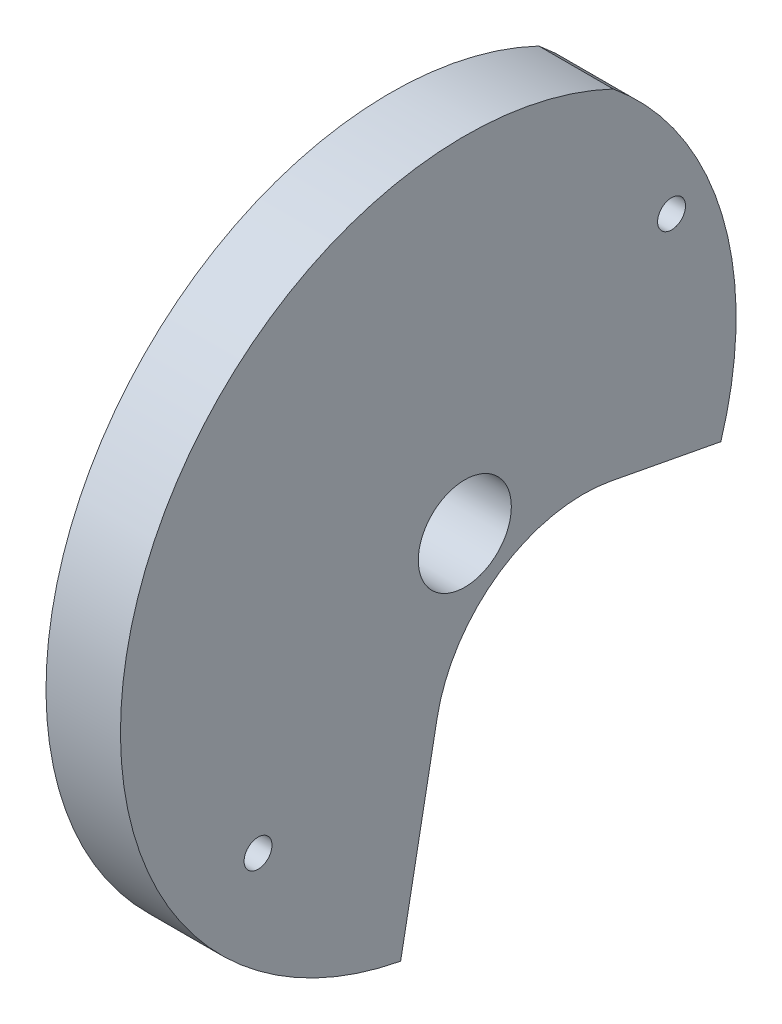
ISO-10303-21;
HEADER;
FILE_DESCRIPTION(('STEP AP214'),'2;1');
FILE_NAME('part.step','',(''),(''),'','','');
FILE_SCHEMA(('AUTOMOTIVE_DESIGN { 1 0 10303 214 1 1 1 1 }'));
ENDSEC;
DATA;
#1=APPLICATION_CONTEXT('core data for automotive mechanical design processes');
#2=APPLICATION_PROTOCOL_DEFINITION('international standard','automotive_design',2000,#1);
#3=PRODUCT_CONTEXT('',#1,'mechanical');
#4=PRODUCT('Part','Part','',(#3));
#5=PRODUCT_RELATED_PRODUCT_CATEGORY('part','',(#4));
#6=PRODUCT_DEFINITION_FORMATION('','',#4);
#7=PRODUCT_DEFINITION_CONTEXT('part definition',#1,'design');
#8=PRODUCT_DEFINITION('design','',#6,#7);
#9=PRODUCT_DEFINITION_SHAPE('','',#8);
#10=(LENGTH_UNIT() NAMED_UNIT(*) SI_UNIT(.MILLI.,.METRE.));
#11=(NAMED_UNIT(*) PLANE_ANGLE_UNIT() SI_UNIT($,.RADIAN.));
#12=(NAMED_UNIT(*) SI_UNIT($,.STERADIAN.) SOLID_ANGLE_UNIT());
#13=UNCERTAINTY_MEASURE_WITH_UNIT(LENGTH_MEASURE(1.E-05),#10,'distance_accuracy_value','');
#14=(GEOMETRIC_REPRESENTATION_CONTEXT(3) GLOBAL_UNCERTAINTY_ASSIGNED_CONTEXT((#13)) GLOBAL_UNIT_ASSIGNED_CONTEXT((#10,
#11,#12)) REPRESENTATION_CONTEXT('',''));
#15=CARTESIAN_POINT('',(0.,0.,0.));
#16=DIRECTION('',(0.,0.,1.));
#17=DIRECTION('',(1.,0.,0.));
#18=AXIS2_PLACEMENT_3D('',#15,#16,#17);
#19=CARTESIAN_POINT('',(4.,0.,0.));
#20=DIRECTION('',(0.,-0.186319167551727,-0.982489271087899));
#21=DIRECTION('',(0.,0.982489271087899,-0.186319167551727));
#22=AXIS2_PLACEMENT_3D('',#19,#20,#21);
#23=PLANE('',#22);
#24=DIRECTION('',(0.,-0.982489271087899,0.186319167551727));
#25=VECTOR('',#24,1.);
#26=CARTESIAN_POINT('',(4.,0.,0.));
#27=LINE('',#26,#25);
#28=CARTESIAN_POINT('',(4.,-7.85991416870302,1.49055334041378));
#29=VERTEX_POINT('',#28);
#30=CARTESIAN_POINT('',(4.,-18.1760515151261,3.44690459970694));
#31=VERTEX_POINT('',#30);
#32=EDGE_CURVE('E145',#29,#31,#27,.T.);
#33=ORIENTED_EDGE('',*,*,#32,.T.);
#34=DIRECTION('',(1.,0.,0.));
#35=VECTOR('',#34,1.);
#36=CARTESIAN_POINT('',(-6.,-18.1760515151261,3.44690459970694));
#37=LINE('',#36,#35);
#38=CARTESIAN_POINT('',(0.,-18.1760515151261,3.44690459970694));
#39=VERTEX_POINT('',#38);
#40=EDGE_CURVE('E98',#31,#39,#37,.F.);
#41=ORIENTED_EDGE('',*,*,#40,.T.);
#42=DIRECTION('',(0.,-0.982489271087899,0.186319167551727));
#43=VECTOR('',#42,1.);
#44=CARTESIAN_POINT('',(0.,0.,0.));
#45=LINE('',#44,#43);
#46=CARTESIAN_POINT('',(0.,-7.85991416870302,1.49055334041378));
#47=VERTEX_POINT('',#46);
#48=EDGE_CURVE('E157',#47,#39,#45,.T.);
#49=ORIENTED_EDGE('',*,*,#48,.F.);
#50=DIRECTION('',(-1.,0.,0.));
#51=VECTOR('',#50,1.);
#52=CARTESIAN_POINT('',(4.,-7.85991416870302,1.49055334041378));
#53=LINE('',#52,#51);
#54=EDGE_CURVE('E49',#29,#47,#53,.T.);
#55=ORIENTED_EDGE('',*,*,#54,.F.);
#56=EDGE_LOOP('',(#33,#41,#49,#55));
#57=FACE_BOUND('',#56,.T.);
#58=ADVANCED_FACE('F42',(#57),#23,.T.);
#59=CARTESIAN_POINT('',(4.,2.76228589628103,3.42522584115657));
#60=DIRECTION('',(-1.,0.,0.));
#61=DIRECTION('',(0.,0.,1.));
#62=AXIS2_PLACEMENT_3D('',#59,#60,#61);
#63=CYLINDRICAL_SURFACE('',#62,18.);
#64=DIRECTION('',(1.,0.,0.));
#65=VECTOR('',#64,1.);
#66=CARTESIAN_POINT('',(-1.,16.6940126550691,-7.97244890058218));
#67=LINE('',#66,#65);
#68=CARTESIAN_POINT('',(4.,16.6940126550691,-7.97244890058218));
#69=VERTEX_POINT('',#68);
#70=CARTESIAN_POINT('',(0.,16.6940126550691,-7.97244890058218));
#71=VERTEX_POINT('',#70);
#72=EDGE_CURVE('E55',#69,#71,#67,.F.);
#73=ORIENTED_EDGE('',*,*,#72,.F.);
#74=CARTESIAN_POINT('',(4.,2.76228589628103,3.42522584115657));
#75=DIRECTION('',(1.,0.,0.));
#76=DIRECTION('',(0.,0.,-1.));
#77=AXIS2_PLACEMENT_3D('',#74,#75,#76);
#78=CIRCLE('',#77,18.);
#79=CARTESIAN_POINT('',(4.,-2.60846834572417,-13.7548497952306));
#80=VERTEX_POINT('',#79);
#81=EDGE_CURVE('E105',#80,#69,#78,.T.);
#82=ORIENTED_EDGE('',*,*,#81,.F.);
#83=DIRECTION('',(-1.,0.,0.));
#84=VECTOR('',#83,1.);
#85=CARTESIAN_POINT('',(4.,-2.60846834572417,-13.7548497952306));
#86=LINE('',#85,#84);
#87=CARTESIAN_POINT('',(0.,-2.60846834572417,-13.7548497952306));
#88=VERTEX_POINT('',#87);
#89=EDGE_CURVE('E115',#80,#88,#86,.T.);
#90=ORIENTED_EDGE('',*,*,#89,.T.);
#91=CARTESIAN_POINT('',(0.,2.76228589628103,3.42522584115657));
#92=DIRECTION('',(1.,0.,0.));
#93=DIRECTION('',(0.,0.,-1.));
#94=AXIS2_PLACEMENT_3D('',#91,#92,#93);
#95=CIRCLE('',#94,18.);
#96=EDGE_CURVE('E107',#88,#71,#95,.T.);
#97=ORIENTED_EDGE('',*,*,#96,.T.);
#98=EDGE_LOOP('',(#73,#82,#90,#97));
#99=FACE_BOUND('',#98,.T.);
#100=ADVANCED_FACE('F104',(#99),#63,.T.);
#101=CARTESIAN_POINT('',(4.,0.,0.));
#102=DIRECTION('',(1.,0.,0.));
#103=DIRECTION('',(0.,0.,-1.));
#104=AXIS2_PLACEMENT_3D('',#101,#102,#103);
#105=PLANE('',#104);
#106=CARTESIAN_POINT('',(4.,9.32042034045475,-11.1076444252252));
#107=DIRECTION('',(1.,0.,0.));
#108=DIRECTION('',(0.,0.,-1.));
#109=AXIS2_PLACEMENT_3D('',#106,#107,#108);
#110=CIRCLE('',#109,0.75);
#111=CARTESIAN_POINT('',(4.,9.32042034045475,-11.8576444252252));
#112=VERTEX_POINT('',#111);
#113=EDGE_CURVE('E133',#112,#112,#110,.T.);
#114=ORIENTED_EDGE('',*,*,#113,.F.);
#115=EDGE_LOOP('',(#114));
#116=FACE_BOUND('',#115,.T.);
#117=CARTESIAN_POINT('',(4.,-9.32042034045483,11.1076444252252));
#118=DIRECTION('',(1.,0.,0.));
#119=DIRECTION('',(0.,0.,-1.));
#120=AXIS2_PLACEMENT_3D('',#117,#118,#119);
#121=CIRCLE('',#120,0.75);
#122=CARTESIAN_POINT('',(4.,-9.32042034045483,10.3576444252252));
#123=VERTEX_POINT('',#122);
#124=EDGE_CURVE('E139',#123,#123,#121,.T.);
#125=ORIENTED_EDGE('',*,*,#124,.F.);
#126=EDGE_LOOP('',(#125));
#127=FACE_BOUND('',#126,.T.);
#128=CARTESIAN_POINT('',(4.,0.,0.));
#129=DIRECTION('',(1.,0.,0.));
#130=DIRECTION('',(0.,0.,-1.));
#131=AXIS2_PLACEMENT_3D('',#128,#129,#130);
#132=CIRCLE('',#131,2.5);
#133=CARTESIAN_POINT('',(4.,0.,-2.5));
#134=VERTEX_POINT('',#133);
#135=EDGE_CURVE('E111',#134,#134,#132,.T.);
#136=ORIENTED_EDGE('',*,*,#135,.F.);
#137=EDGE_LOOP('',(#136));
#138=FACE_BOUND('',#137,.T.);
#139=ORIENTED_EDGE('',*,*,#81,.T.);
#140=CARTESIAN_POINT('',(4.,0.,0.));
#141=DIRECTION('',(1.,0.,0.));
#142=DIRECTION('',(0.,0.,-1.));
#143=AXIS2_PLACEMENT_3D('',#140,#141,#142);
#144=CIRCLE('',#143,18.5);
#145=EDGE_CURVE('E95',#69,#31,#144,.T.);
#146=ORIENTED_EDGE('',*,*,#145,.T.);
#147=ORIENTED_EDGE('',*,*,#32,.F.);
#148=CARTESIAN_POINT('',(4.,-9.35046750911686,-6.3693608282896));
#149=DIRECTION('',(1.,0.,0.));
#150=DIRECTION('',(0.,0.,-1.));
#151=AXIS2_PLACEMENT_3D('',#148,#149,#150);
#152=CIRCLE('',#151,7.99999999999896);
#153=CARTESIAN_POINT('',(4.,-1.49055334041385,-7.85991416870338));
#154=VERTEX_POINT('',#153);
#155=EDGE_CURVE('E118',#154,#29,#152,.T.);
#156=ORIENTED_EDGE('',*,*,#155,.F.);
#157=DIRECTION('',(0.,-0.186319167551727,-0.982489271087899));
#158=VECTOR('',#157,1.);
#159=CARTESIAN_POINT('',(4.,0.,0.));
#160=LINE('',#159,#158);
#161=EDGE_CURVE('E64',#154,#80,#160,.T.);
#162=ORIENTED_EDGE('',*,*,#161,.T.);
#163=EDGE_LOOP('',(#139,#146,#147,#156,#162));
#164=FACE_BOUND('',#163,.T.);
#165=ADVANCED_FACE('F109',(#116,#127,#138,#164),#105,.T.);
#166=CARTESIAN_POINT('',(0.,0.,0.));
#167=DIRECTION('',(1.,0.,0.));
#168=DIRECTION('',(0.,0.,-1.));
#169=AXIS2_PLACEMENT_3D('',#166,#167,#168);
#170=PLANE('',#169);
#171=CARTESIAN_POINT('',(0.,0.,0.));
#172=DIRECTION('',(1.,0.,0.));
#173=DIRECTION('',(0.,0.,-1.));
#174=AXIS2_PLACEMENT_3D('',#171,#172,#173);
#175=CIRCLE('',#174,2.5);
#176=CARTESIAN_POINT('',(0.,0.,-2.5));
#177=VERTEX_POINT('',#176);
#178=EDGE_CURVE('E148',#177,#177,#175,.T.);
#179=ORIENTED_EDGE('',*,*,#178,.T.);
#180=EDGE_LOOP('',(#179));
#181=FACE_BOUND('',#180,.T.);
#182=CARTESIAN_POINT('',(0.,-9.32042034045483,11.1076444252252));
#183=DIRECTION('',(1.,0.,0.));
#184=DIRECTION('',(0.,0.,-1.));
#185=AXIS2_PLACEMENT_3D('',#182,#183,#184);
#186=CIRCLE('',#185,0.75);
#187=CARTESIAN_POINT('',(0.,-9.32042034045483,10.3576444252252));
#188=VERTEX_POINT('',#187);
#189=EDGE_CURVE('E144',#188,#188,#186,.T.);
#190=ORIENTED_EDGE('',*,*,#189,.T.);
#191=EDGE_LOOP('',(#190));
#192=FACE_BOUND('',#191,.T.);
#193=CARTESIAN_POINT('',(0.,9.32042034045475,-11.1076444252252));
#194=DIRECTION('',(1.,0.,0.));
#195=DIRECTION('',(0.,0.,-1.));
#196=AXIS2_PLACEMENT_3D('',#193,#194,#195);
#197=CIRCLE('',#196,0.75);
#198=CARTESIAN_POINT('',(0.,9.32042034045475,-11.8576444252252));
#199=VERTEX_POINT('',#198);
#200=EDGE_CURVE('E138',#199,#199,#197,.T.);
#201=ORIENTED_EDGE('',*,*,#200,.T.);
#202=EDGE_LOOP('',(#201));
#203=FACE_BOUND('',#202,.T.);
#204=CARTESIAN_POINT('',(0.,0.,0.));
#205=DIRECTION('',(1.,0.,0.));
#206=DIRECTION('',(0.,0.,-1.));
#207=AXIS2_PLACEMENT_3D('',#204,#205,#206);
#208=CIRCLE('',#207,18.5);
#209=EDGE_CURVE('E12',#71,#39,#208,.T.);
#210=ORIENTED_EDGE('',*,*,#209,.F.);
#211=ORIENTED_EDGE('',*,*,#96,.F.);
#212=DIRECTION('',(0.,-0.186319167551727,-0.982489271087899));
#213=VECTOR('',#212,1.);
#214=CARTESIAN_POINT('',(0.,0.,0.));
#215=LINE('',#214,#213);
#216=CARTESIAN_POINT('',(0.,-1.49055334041385,-7.85991416870338));
#217=VERTEX_POINT('',#216);
#218=EDGE_CURVE('E81',#217,#88,#215,.T.);
#219=ORIENTED_EDGE('',*,*,#218,.F.);
#220=CARTESIAN_POINT('',(0.,-9.35046750911686,-6.3693608282896));
#221=DIRECTION('',(1.,0.,0.));
#222=DIRECTION('',(0.,0.,-1.));
#223=AXIS2_PLACEMENT_3D('',#220,#221,#222);
#224=CIRCLE('',#223,7.99999999999896);
#225=EDGE_CURVE('E161',#217,#47,#224,.T.);
#226=ORIENTED_EDGE('',*,*,#225,.T.);
#227=ORIENTED_EDGE('',*,*,#48,.T.);
#228=EDGE_LOOP('',(#210,#211,#219,#226,#227));
#229=FACE_BOUND('',#228,.T.);
#230=ADVANCED_FACE('F160',(#181,#192,#203,#229),#170,.F.);
#231=CARTESIAN_POINT('',(4.,-9.35046750911686,-6.3693608282896));
#232=DIRECTION('',(-1.,0.,0.));
#233=DIRECTION('',(0.,0.,1.));
#234=AXIS2_PLACEMENT_3D('',#231,#232,#233);
#235=CYLINDRICAL_SURFACE('',#234,7.99999999999896);
#236=ORIENTED_EDGE('',*,*,#225,.F.);
#237=DIRECTION('',(-1.,0.,0.));
#238=VECTOR('',#237,1.);
#239=CARTESIAN_POINT('',(4.,-1.49055334041385,-7.85991416870338));
#240=LINE('',#239,#238);
#241=EDGE_CURVE('E155',#154,#217,#240,.T.);
#242=ORIENTED_EDGE('',*,*,#241,.F.);
#243=ORIENTED_EDGE('',*,*,#155,.T.);
#244=ORIENTED_EDGE('',*,*,#54,.T.);
#245=EDGE_LOOP('',(#236,#242,#243,#244));
#246=FACE_BOUND('',#245,.T.);
#247=ADVANCED_FACE('F154',(#246),#235,.F.);
#248=CARTESIAN_POINT('',(4.,0.,0.));
#249=DIRECTION('',(0.,0.982489271087899,-0.186319167551727));
#250=DIRECTION('',(0.,0.186319167551727,0.982489271087899));
#251=AXIS2_PLACEMENT_3D('',#248,#249,#250);
#252=PLANE('',#251);
#253=ORIENTED_EDGE('',*,*,#218,.T.);
#254=ORIENTED_EDGE('',*,*,#89,.F.);
#255=ORIENTED_EDGE('',*,*,#161,.F.);
#256=ORIENTED_EDGE('',*,*,#241,.T.);
#257=EDGE_LOOP('',(#253,#254,#255,#256));
#258=FACE_BOUND('',#257,.T.);
#259=ADVANCED_FACE('F202',(#258),#252,.F.);
#260=CARTESIAN_POINT('',(4.,0.,0.));
#261=DIRECTION('',(-1.,0.,0.));
#262=DIRECTION('',(0.,0.,1.));
#263=AXIS2_PLACEMENT_3D('',#260,#261,#262);
#264=CYLINDRICAL_SURFACE('',#263,2.5);
#265=ORIENTED_EDGE('',*,*,#135,.T.);
#266=EDGE_LOOP('',(#265));
#267=FACE_BOUND('',#266,.T.);
#268=ORIENTED_EDGE('',*,*,#178,.F.);
#269=EDGE_LOOP('',(#268));
#270=FACE_BOUND('',#269,.T.);
#271=ADVANCED_FACE('F186',(#267,#270),#264,.F.);
#272=CARTESIAN_POINT('',(-6.,-9.32042034045483,11.1076444252252));
#273=DIRECTION('',(1.,0.,0.));
#274=DIRECTION('',(0.,0.,-1.));
#275=AXIS2_PLACEMENT_3D('',#272,#273,#274);
#276=CYLINDRICAL_SURFACE('',#275,0.75);
#277=ORIENTED_EDGE('',*,*,#124,.T.);
#278=EDGE_LOOP('',(#277));
#279=FACE_BOUND('',#278,.T.);
#280=ORIENTED_EDGE('',*,*,#189,.F.);
#281=EDGE_LOOP('',(#280));
#282=FACE_BOUND('',#281,.T.);
#283=ADVANCED_FACE('F178',(#279,#282),#276,.F.);
#284=CARTESIAN_POINT('',(-6.,9.32042034045475,-11.1076444252252));
#285=DIRECTION('',(1.,0.,0.));
#286=DIRECTION('',(0.,0.,-1.));
#287=AXIS2_PLACEMENT_3D('',#284,#285,#286);
#288=CYLINDRICAL_SURFACE('',#287,0.75);
#289=ORIENTED_EDGE('',*,*,#113,.T.);
#290=EDGE_LOOP('',(#289));
#291=FACE_BOUND('',#290,.T.);
#292=ORIENTED_EDGE('',*,*,#200,.F.);
#293=EDGE_LOOP('',(#292));
#294=FACE_BOUND('',#293,.T.);
#295=ADVANCED_FACE('F176',(#291,#294),#288,.F.);
#296=CARTESIAN_POINT('',(-6.,0.,0.));
#297=DIRECTION('',(1.,0.,0.));
#298=DIRECTION('',(0.,0.,-1.));
#299=AXIS2_PLACEMENT_3D('',#296,#297,#298);
#300=CYLINDRICAL_SURFACE('',#299,18.5);
#301=ORIENTED_EDGE('',*,*,#145,.F.);
#302=ORIENTED_EDGE('',*,*,#72,.T.);
#303=ORIENTED_EDGE('',*,*,#209,.T.);
#304=ORIENTED_EDGE('',*,*,#40,.F.);
#305=EDGE_LOOP('',(#301,#302,#303,#304));
#306=FACE_BOUND('',#305,.T.);
#307=ADVANCED_FACE('F96',(#306),#300,.T.);
#308=CLOSED_SHELL('',(#58,#100,#165,#230,#247,#259,#271,#283,#295,#307));
#309=MANIFOLD_SOLID_BREP('B2',#308);
#310=ADVANCED_BREP_SHAPE_REPRESENTATION('',(#18,#309),#14);
#311=SHAPE_DEFINITION_REPRESENTATION(#9,#310);
ENDSEC;
END-ISO-10303-21;
